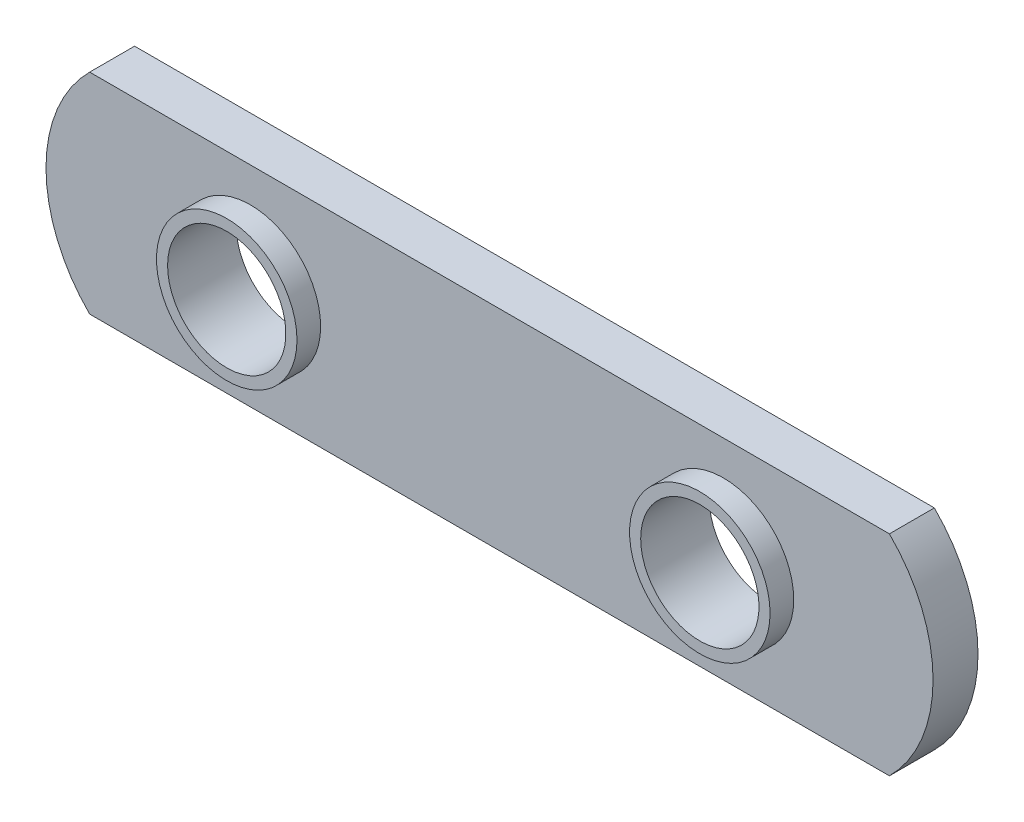
ISO-10303-21;
HEADER;
FILE_DESCRIPTION(('STEP AP214'),'2;1');
FILE_NAME('part.step','',(''),(''),'','','');
FILE_SCHEMA(('AUTOMOTIVE_DESIGN { 1 0 10303 214 1 1 1 1 }'));
ENDSEC;
DATA;
#1=APPLICATION_CONTEXT('core data for automotive mechanical design processes');
#2=APPLICATION_PROTOCOL_DEFINITION('international standard','automotive_design',2000,#1);
#3=PRODUCT_CONTEXT('',#1,'mechanical');
#4=PRODUCT('Part','Part','',(#3));
#5=PRODUCT_RELATED_PRODUCT_CATEGORY('part','',(#4));
#6=PRODUCT_DEFINITION_FORMATION('','',#4);
#7=PRODUCT_DEFINITION_CONTEXT('part definition',#1,'design');
#8=PRODUCT_DEFINITION('design','',#6,#7);
#9=PRODUCT_DEFINITION_SHAPE('','',#8);
#10=(LENGTH_UNIT() NAMED_UNIT(*) SI_UNIT(.MILLI.,.METRE.));
#11=(NAMED_UNIT(*) PLANE_ANGLE_UNIT() SI_UNIT($,.RADIAN.));
#12=(NAMED_UNIT(*) SI_UNIT($,.STERADIAN.) SOLID_ANGLE_UNIT());
#13=UNCERTAINTY_MEASURE_WITH_UNIT(LENGTH_MEASURE(1.E-05),#10,'distance_accuracy_value','');
#14=(GEOMETRIC_REPRESENTATION_CONTEXT(3) GLOBAL_UNCERTAINTY_ASSIGNED_CONTEXT((#13)) GLOBAL_UNIT_ASSIGNED_CONTEXT((#10,
#11,#12)) REPRESENTATION_CONTEXT('',''));
#15=CARTESIAN_POINT('',(0.,0.,0.));
#16=DIRECTION('',(0.,0.,1.));
#17=DIRECTION('',(1.,0.,0.));
#18=AXIS2_PLACEMENT_3D('',#15,#16,#17);
#19=CARTESIAN_POINT('',(107.347760264315,128.471327571716,2.413));
#20=DIRECTION('',(0.,0.,1.));
#21=DIRECTION('',(1.,0.,0.));
#22=AXIS2_PLACEMENT_3D('',#19,#20,#21);
#23=PLANE('',#22);
#24=CARTESIAN_POINT('',(135.795760264315,128.471327571716,2.413));
#25=DIRECTION('',(0.,0.,1.));
#26=DIRECTION('',(1.,0.,0.));
#27=AXIS2_PLACEMENT_3D('',#24,#25,#26);
#28=CIRCLE('',#27,3.77189999999998);
#29=CARTESIAN_POINT('',(139.567660264315,128.471327571716,2.413));
#30=VERTEX_POINT('',#29);
#31=EDGE_CURVE('E111',#30,#30,#28,.T.);
#32=ORIENTED_EDGE('',*,*,#31,.F.);
#33=EDGE_LOOP('',(#32));
#34=FACE_BOUND('',#33,.T.);
#35=CARTESIAN_POINT('',(107.347760264315,128.471327571716,2.413));
#36=DIRECTION('',(0.,0.,1.));
#37=DIRECTION('',(1.,0.,0.));
#38=AXIS2_PLACEMENT_3D('',#35,#36,#37);
#39=CIRCLE('',#38,7.92480000000008);
#40=CARTESIAN_POINT('',(101.766590688858,134.097427571716,2.413));
#41=VERTEX_POINT('',#40);
#42=CARTESIAN_POINT('',(101.766590688858,122.845227571716,2.413));
#43=VERTEX_POINT('',#42);
#44=EDGE_CURVE('E85',#41,#43,#39,.T.);
#45=ORIENTED_EDGE('',*,*,#44,.T.);
#46=DIRECTION('',(1.,0.,0.));
#47=VECTOR('',#46,1.);
#48=CARTESIAN_POINT('',(101.766590688858,122.845227571716,2.413));
#49=LINE('',#48,#47);
#50=CARTESIAN_POINT('',(144.704329839771,122.845227571716,2.413));
#51=VERTEX_POINT('',#50);
#52=EDGE_CURVE('E80',#43,#51,#49,.T.);
#53=ORIENTED_EDGE('',*,*,#52,.T.);
#54=CARTESIAN_POINT('',(139.123160264315,128.471327571716,2.413));
#55=DIRECTION('',(0.,0.,1.));
#56=DIRECTION('',(1.,0.,0.));
#57=AXIS2_PLACEMENT_3D('',#54,#55,#56);
#58=CIRCLE('',#57,7.9248000000001);
#59=CARTESIAN_POINT('',(144.704329839771,134.097427571716,2.413));
#60=VERTEX_POINT('',#59);
#61=EDGE_CURVE('E83',#51,#60,#58,.T.);
#62=ORIENTED_EDGE('',*,*,#61,.T.);
#63=DIRECTION('',(-1.,0.,0.));
#64=VECTOR('',#63,1.);
#65=CARTESIAN_POINT('',(101.766590688858,134.097427571716,2.413));
#66=LINE('',#65,#64);
#67=EDGE_CURVE('E50',#60,#41,#66,.T.);
#68=ORIENTED_EDGE('',*,*,#67,.T.);
#69=EDGE_LOOP('',(#45,#53,#62,#68));
#70=FACE_BOUND('',#69,.T.);
#71=CARTESIAN_POINT('',(110.395760264315,128.471327571716,2.413));
#72=DIRECTION('',(0.,0.,1.));
#73=DIRECTION('',(1.,0.,0.));
#74=AXIS2_PLACEMENT_3D('',#71,#72,#73);
#75=CIRCLE('',#74,3.77189999999999);
#76=CARTESIAN_POINT('',(114.167660264315,128.471327571716,2.413));
#77=VERTEX_POINT('',#76);
#78=EDGE_CURVE('E117',#77,#77,#75,.T.);
#79=ORIENTED_EDGE('',*,*,#78,.F.);
#80=EDGE_LOOP('',(#79));
#81=FACE_BOUND('',#80,.T.);
#82=ADVANCED_FACE('F33',(#34,#70,#81),#23,.T.);
#83=CARTESIAN_POINT('',(107.347760264315,128.471327571716,2.413));
#84=DIRECTION('',(0.,0.,-1.));
#85=DIRECTION('',(-1.,0.,0.));
#86=AXIS2_PLACEMENT_3D('',#83,#84,#85);
#87=CYLINDRICAL_SURFACE('',#86,7.92480000000008);
#88=CARTESIAN_POINT('',(107.347760264315,128.471327571716,0.));
#89=DIRECTION('',(0.,0.,1.));
#90=DIRECTION('',(1.,0.,0.));
#91=AXIS2_PLACEMENT_3D('',#88,#89,#90);
#92=CIRCLE('',#91,7.92480000000008);
#93=CARTESIAN_POINT('',(101.766590688858,134.097427571716,0.));
#94=VERTEX_POINT('',#93);
#95=CARTESIAN_POINT('',(101.766590688858,122.845227571716,0.));
#96=VERTEX_POINT('',#95);
#97=EDGE_CURVE('E97',#94,#96,#92,.T.);
#98=ORIENTED_EDGE('',*,*,#97,.T.);
#99=DIRECTION('',(0.,0.,-1.));
#100=VECTOR('',#99,1.);
#101=CARTESIAN_POINT('',(101.766590688858,122.845227571716,2.413));
#102=LINE('',#101,#100);
#103=EDGE_CURVE('E11',#43,#96,#102,.T.);
#104=ORIENTED_EDGE('',*,*,#103,.F.);
#105=ORIENTED_EDGE('',*,*,#44,.F.);
#106=DIRECTION('',(0.,0.,-1.));
#107=VECTOR('',#106,1.);
#108=CARTESIAN_POINT('',(101.766590688858,134.097427571716,2.413));
#109=LINE('',#108,#107);
#110=EDGE_CURVE('E93',#41,#94,#109,.T.);
#111=ORIENTED_EDGE('',*,*,#110,.T.);
#112=EDGE_LOOP('',(#98,#104,#105,#111));
#113=FACE_BOUND('',#112,.T.);
#114=ADVANCED_FACE('F35',(#113),#87,.T.);
#115=CARTESIAN_POINT('',(101.766590688858,122.845227571716,2.413));
#116=DIRECTION('',(0.,1.,0.));
#117=DIRECTION('',(0.,0.,1.));
#118=AXIS2_PLACEMENT_3D('',#115,#116,#117);
#119=PLANE('',#118);
#120=DIRECTION('',(1.,0.,0.));
#121=VECTOR('',#120,1.);
#122=CARTESIAN_POINT('',(101.766590688858,122.845227571716,0.));
#123=LINE('',#122,#121);
#124=CARTESIAN_POINT('',(144.704329839771,122.845227571716,0.));
#125=VERTEX_POINT('',#124);
#126=EDGE_CURVE('E89',#96,#125,#123,.T.);
#127=ORIENTED_EDGE('',*,*,#126,.T.);
#128=DIRECTION('',(0.,0.,-1.));
#129=VECTOR('',#128,1.);
#130=CARTESIAN_POINT('',(144.704329839771,122.845227571716,2.413));
#131=LINE('',#130,#129);
#132=EDGE_CURVE('E42',#51,#125,#131,.T.);
#133=ORIENTED_EDGE('',*,*,#132,.F.);
#134=ORIENTED_EDGE('',*,*,#52,.F.);
#135=ORIENTED_EDGE('',*,*,#103,.T.);
#136=EDGE_LOOP('',(#127,#133,#134,#135));
#137=FACE_BOUND('',#136,.T.);
#138=ADVANCED_FACE('F88',(#137),#119,.F.);
#139=CARTESIAN_POINT('',(139.123160264315,128.471327571716,2.413));
#140=DIRECTION('',(0.,0.,-1.));
#141=DIRECTION('',(-1.,0.,0.));
#142=AXIS2_PLACEMENT_3D('',#139,#140,#141);
#143=CYLINDRICAL_SURFACE('',#142,7.9248000000001);
#144=CARTESIAN_POINT('',(139.123160264315,128.471327571716,0.));
#145=DIRECTION('',(0.,0.,1.));
#146=DIRECTION('',(1.,0.,0.));
#147=AXIS2_PLACEMENT_3D('',#144,#145,#146);
#148=CIRCLE('',#147,7.9248000000001);
#149=CARTESIAN_POINT('',(144.704329839771,134.097427571716,0.));
#150=VERTEX_POINT('',#149);
#151=EDGE_CURVE('E67',#125,#150,#148,.T.);
#152=ORIENTED_EDGE('',*,*,#151,.T.);
#153=DIRECTION('',(0.,0.,-1.));
#154=VECTOR('',#153,1.);
#155=CARTESIAN_POINT('',(144.704329839771,134.097427571716,2.413));
#156=LINE('',#155,#154);
#157=EDGE_CURVE('E90',#60,#150,#156,.T.);
#158=ORIENTED_EDGE('',*,*,#157,.F.);
#159=ORIENTED_EDGE('',*,*,#61,.F.);
#160=ORIENTED_EDGE('',*,*,#132,.T.);
#161=EDGE_LOOP('',(#152,#158,#159,#160));
#162=FACE_BOUND('',#161,.T.);
#163=ADVANCED_FACE('F91',(#162),#143,.T.);
#164=CARTESIAN_POINT('',(101.766590688858,134.097427571716,2.413));
#165=DIRECTION('',(0.,-1.,0.));
#166=DIRECTION('',(1.,0.,0.));
#167=AXIS2_PLACEMENT_3D('',#164,#165,#166);
#168=PLANE('',#167);
#169=DIRECTION('',(-1.,0.,0.));
#170=VECTOR('',#169,1.);
#171=CARTESIAN_POINT('',(101.766590688858,134.097427571716,0.));
#172=LINE('',#171,#170);
#173=EDGE_CURVE('E73',#150,#94,#172,.T.);
#174=ORIENTED_EDGE('',*,*,#173,.T.);
#175=ORIENTED_EDGE('',*,*,#110,.F.);
#176=ORIENTED_EDGE('',*,*,#67,.F.);
#177=ORIENTED_EDGE('',*,*,#157,.T.);
#178=EDGE_LOOP('',(#174,#175,#176,#177));
#179=FACE_BOUND('',#178,.T.);
#180=ADVANCED_FACE('F105',(#179),#168,.F.);
#181=CARTESIAN_POINT('',(107.347760264315,128.471327571716,0.));
#182=DIRECTION('',(0.,0.,1.));
#183=DIRECTION('',(1.,0.,0.));
#184=AXIS2_PLACEMENT_3D('',#181,#182,#183);
#185=PLANE('',#184);
#186=CARTESIAN_POINT('',(110.395760264315,128.471327571716,0.));
#187=DIRECTION('',(0.,0.,-1.));
#188=DIRECTION('',(-1.,0.,0.));
#189=AXIS2_PLACEMENT_3D('',#186,#187,#188);
#190=CIRCLE('',#189,3.175);
#191=CARTESIAN_POINT('',(107.220760264315,128.471327571716,0.));
#192=VERTEX_POINT('',#191);
#193=EDGE_CURVE('E129',#192,#192,#190,.T.);
#194=ORIENTED_EDGE('',*,*,#193,.F.);
#195=EDGE_LOOP('',(#194));
#196=FACE_BOUND('',#195,.T.);
#197=CARTESIAN_POINT('',(135.795760264315,128.471327571716,0.));
#198=DIRECTION('',(0.,0.,-1.));
#199=DIRECTION('',(-1.,0.,0.));
#200=AXIS2_PLACEMENT_3D('',#197,#198,#199);
#201=CIRCLE('',#200,3.175);
#202=CARTESIAN_POINT('',(132.620760264315,128.471327571716,0.));
#203=VERTEX_POINT('',#202);
#204=EDGE_CURVE('E123',#203,#203,#201,.T.);
#205=ORIENTED_EDGE('',*,*,#204,.F.);
#206=EDGE_LOOP('',(#205));
#207=FACE_BOUND('',#206,.T.);
#208=ORIENTED_EDGE('',*,*,#97,.F.);
#209=ORIENTED_EDGE('',*,*,#173,.F.);
#210=ORIENTED_EDGE('',*,*,#151,.F.);
#211=ORIENTED_EDGE('',*,*,#126,.F.);
#212=EDGE_LOOP('',(#208,#209,#210,#211));
#213=FACE_BOUND('',#212,.T.);
#214=ADVANCED_FACE('F108',(#196,#207,#213),#185,.F.);
#215=CARTESIAN_POINT('',(135.795760264315,128.471327571716,3.683));
#216=DIRECTION('',(0.,0.,-1.));
#217=DIRECTION('',(-1.,0.,0.));
#218=AXIS2_PLACEMENT_3D('',#215,#216,#217);
#219=CYLINDRICAL_SURFACE('',#218,3.77189999999998);
#220=CARTESIAN_POINT('',(135.795760264315,128.471327571716,3.683));
#221=DIRECTION('',(0.,0.,1.));
#222=DIRECTION('',(1.,0.,0.));
#223=AXIS2_PLACEMENT_3D('',#220,#221,#222);
#224=CIRCLE('',#223,3.77189999999998);
#225=CARTESIAN_POINT('',(139.567660264315,128.471327571716,3.683));
#226=VERTEX_POINT('',#225);
#227=EDGE_CURVE('E100',#226,#226,#224,.T.);
#228=ORIENTED_EDGE('',*,*,#227,.F.);
#229=EDGE_LOOP('',(#228));
#230=FACE_BOUND('',#229,.T.);
#231=ORIENTED_EDGE('',*,*,#31,.T.);
#232=EDGE_LOOP('',(#231));
#233=FACE_BOUND('',#232,.T.);
#234=ADVANCED_FACE('F147',(#230,#233),#219,.T.);
#235=CARTESIAN_POINT('',(135.795760264315,128.471327571716,3.683));
#236=DIRECTION('',(0.,0.,1.));
#237=DIRECTION('',(1.,0.,0.));
#238=AXIS2_PLACEMENT_3D('',#235,#236,#237);
#239=PLANE('',#238);
#240=CARTESIAN_POINT('',(135.795760264315,128.471327571716,3.683));
#241=DIRECTION('',(0.,0.,-1.));
#242=DIRECTION('',(-1.,0.,0.));
#243=AXIS2_PLACEMENT_3D('',#240,#241,#242);
#244=CIRCLE('',#243,3.175);
#245=CARTESIAN_POINT('',(132.620760264315,128.471327571716,3.683));
#246=VERTEX_POINT('',#245);
#247=EDGE_CURVE('E120',#246,#246,#244,.T.);
#248=ORIENTED_EDGE('',*,*,#247,.T.);
#249=EDGE_LOOP('',(#248));
#250=FACE_BOUND('',#249,.T.);
#251=ORIENTED_EDGE('',*,*,#227,.T.);
#252=EDGE_LOOP('',(#251));
#253=FACE_BOUND('',#252,.T.);
#254=ADVANCED_FACE('F198',(#250,#253),#239,.T.);
#255=CARTESIAN_POINT('',(110.395760264315,128.471327571716,3.683));
#256=DIRECTION('',(0.,0.,-1.));
#257=DIRECTION('',(-1.,0.,0.));
#258=AXIS2_PLACEMENT_3D('',#255,#256,#257);
#259=CYLINDRICAL_SURFACE('',#258,3.77189999999999);
#260=CARTESIAN_POINT('',(110.395760264315,128.471327571716,3.683));
#261=DIRECTION('',(0.,0.,1.));
#262=DIRECTION('',(1.,0.,0.));
#263=AXIS2_PLACEMENT_3D('',#260,#261,#262);
#264=CIRCLE('',#263,3.77189999999999);
#265=CARTESIAN_POINT('',(114.167660264315,128.471327571716,3.683));
#266=VERTEX_POINT('',#265);
#267=EDGE_CURVE('E114',#266,#266,#264,.T.);
#268=ORIENTED_EDGE('',*,*,#267,.F.);
#269=EDGE_LOOP('',(#268));
#270=FACE_BOUND('',#269,.T.);
#271=ORIENTED_EDGE('',*,*,#78,.T.);
#272=EDGE_LOOP('',(#271));
#273=FACE_BOUND('',#272,.T.);
#274=ADVANCED_FACE('F157',(#270,#273),#259,.T.);
#275=CARTESIAN_POINT('',(110.395760264315,128.471327571716,3.683));
#276=DIRECTION('',(0.,0.,1.));
#277=DIRECTION('',(1.,0.,0.));
#278=AXIS2_PLACEMENT_3D('',#275,#276,#277);
#279=PLANE('',#278);
#280=CARTESIAN_POINT('',(110.395760264315,128.471327571716,3.683));
#281=DIRECTION('',(0.,0.,-1.));
#282=DIRECTION('',(-1.,0.,0.));
#283=AXIS2_PLACEMENT_3D('',#280,#281,#282);
#284=CIRCLE('',#283,3.175);
#285=CARTESIAN_POINT('',(107.220760264315,128.471327571716,3.683));
#286=VERTEX_POINT('',#285);
#287=EDGE_CURVE('E126',#286,#286,#284,.T.);
#288=ORIENTED_EDGE('',*,*,#287,.T.);
#289=EDGE_LOOP('',(#288));
#290=FACE_BOUND('',#289,.T.);
#291=ORIENTED_EDGE('',*,*,#267,.T.);
#292=EDGE_LOOP('',(#291));
#293=FACE_BOUND('',#292,.T.);
#294=ADVANCED_FACE('F135',(#290,#293),#279,.T.);
#295=CARTESIAN_POINT('',(135.795760264315,128.471327571716,3.683));
#296=DIRECTION('',(0.,0.,-1.));
#297=DIRECTION('',(-1.,0.,0.));
#298=AXIS2_PLACEMENT_3D('',#295,#296,#297);
#299=CYLINDRICAL_SURFACE('',#298,3.175);
#300=ORIENTED_EDGE('',*,*,#247,.F.);
#301=EDGE_LOOP('',(#300));
#302=FACE_BOUND('',#301,.T.);
#303=ORIENTED_EDGE('',*,*,#204,.T.);
#304=EDGE_LOOP('',(#303));
#305=FACE_BOUND('',#304,.T.);
#306=ADVANCED_FACE('F141',(#302,#305),#299,.F.);
#307=CARTESIAN_POINT('',(110.395760264315,128.471327571716,3.683));
#308=DIRECTION('',(0.,0.,-1.));
#309=DIRECTION('',(-1.,0.,0.));
#310=AXIS2_PLACEMENT_3D('',#307,#308,#309);
#311=CYLINDRICAL_SURFACE('',#310,3.175);
#312=ORIENTED_EDGE('',*,*,#287,.F.);
#313=EDGE_LOOP('',(#312));
#314=FACE_BOUND('',#313,.T.);
#315=ORIENTED_EDGE('',*,*,#193,.T.);
#316=EDGE_LOOP('',(#315));
#317=FACE_BOUND('',#316,.T.);
#318=ADVANCED_FACE('F138',(#314,#317),#311,.F.);
#319=CLOSED_SHELL('',(#82,#114,#138,#163,#180,#214,#234,#254,#274,#294,#306,#318));
#320=MANIFOLD_SOLID_BREP('B2',#319);
#321=ADVANCED_BREP_SHAPE_REPRESENTATION('',(#18,#320),#14);
#322=SHAPE_DEFINITION_REPRESENTATION(#9,#321);
ENDSEC;
END-ISO-10303-21;
